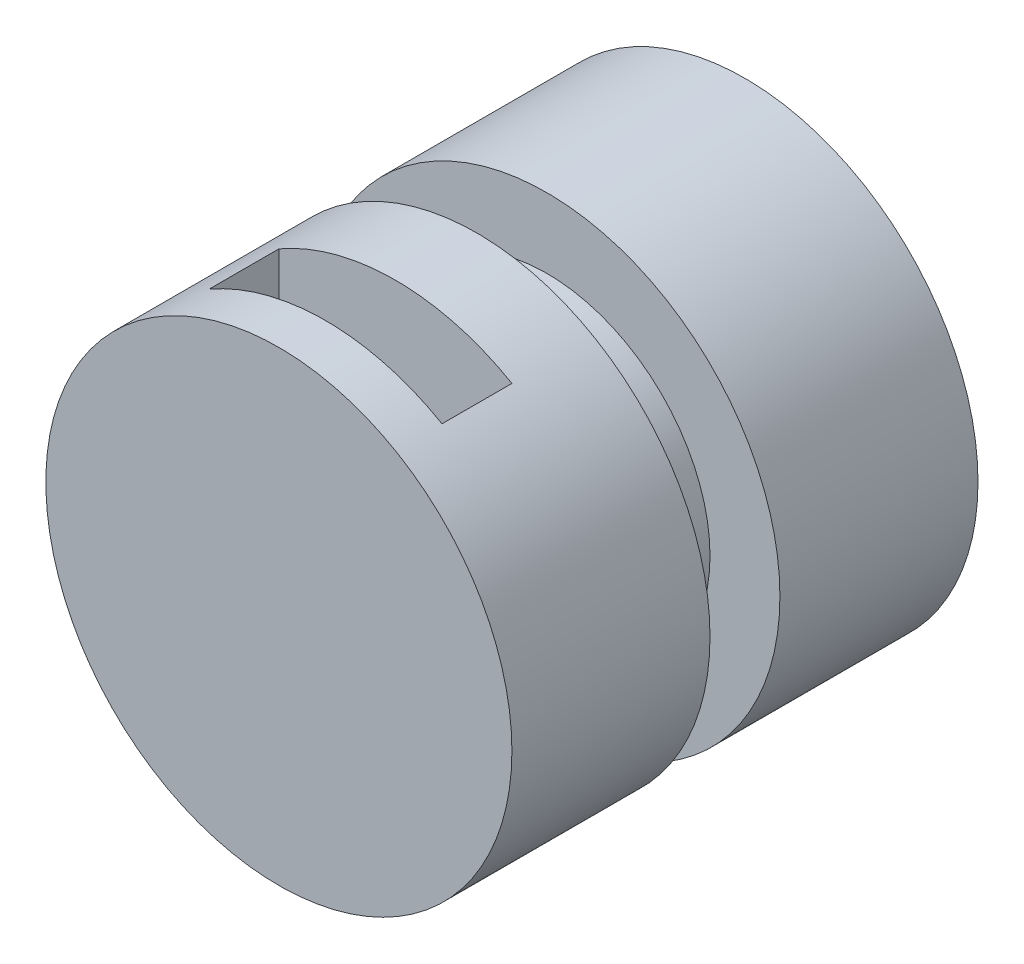
ISO-10303-21;
HEADER;
FILE_DESCRIPTION(('STEP AP214'),'2;1');
FILE_NAME('part.step','',(''),(''),'','','');
FILE_SCHEMA(('AUTOMOTIVE_DESIGN { 1 0 10303 214 1 1 1 1 }'));
ENDSEC;
DATA;
#1=APPLICATION_CONTEXT('core data for automotive mechanical design processes');
#2=APPLICATION_PROTOCOL_DEFINITION('international standard','automotive_design',2000,#1);
#3=PRODUCT_CONTEXT('',#1,'mechanical');
#4=PRODUCT('Part','Part','',(#3));
#5=PRODUCT_RELATED_PRODUCT_CATEGORY('part','',(#4));
#6=PRODUCT_DEFINITION_FORMATION('','',#4);
#7=PRODUCT_DEFINITION_CONTEXT('part definition',#1,'design');
#8=PRODUCT_DEFINITION('design','',#6,#7);
#9=PRODUCT_DEFINITION_SHAPE('','',#8);
#10=(LENGTH_UNIT() NAMED_UNIT(*) SI_UNIT(.MILLI.,.METRE.));
#11=(NAMED_UNIT(*) PLANE_ANGLE_UNIT() SI_UNIT($,.RADIAN.));
#12=(NAMED_UNIT(*) SI_UNIT($,.STERADIAN.) SOLID_ANGLE_UNIT());
#13=UNCERTAINTY_MEASURE_WITH_UNIT(LENGTH_MEASURE(1.E-05),#10,'distance_accuracy_value','');
#14=(GEOMETRIC_REPRESENTATION_CONTEXT(3) GLOBAL_UNCERTAINTY_ASSIGNED_CONTEXT((#13)) GLOBAL_UNIT_ASSIGNED_CONTEXT((#10,
#11,#12)) REPRESENTATION_CONTEXT('',''));
#15=CARTESIAN_POINT('',(0.,0.,0.));
#16=DIRECTION('',(0.,0.,1.));
#17=DIRECTION('',(1.,0.,0.));
#18=AXIS2_PLACEMENT_3D('',#15,#16,#17);
#19=CARTESIAN_POINT('',(0.,0.,5.47950703664449E-12));
#20=DIRECTION('',(0.,0.,1.));
#21=DIRECTION('',(1.,0.,0.));
#22=AXIS2_PLACEMENT_3D('',#19,#20,#21);
#23=PLANE('',#22);
#24=CARTESIAN_POINT('',(0.,0.,1.11022302462516E-11));
#25=DIRECTION('',(0.,0.,1.));
#26=DIRECTION('',(1.,0.,0.));
#27=AXIS2_PLACEMENT_3D('',#24,#25,#26);
#28=CIRCLE('',#27,1000.);
#29=CARTESIAN_POINT('',(1000.,0.,1.33797342119491E-11));
#30=VERTEX_POINT('',#29);
#31=EDGE_CURVE('E78',#30,#30,#28,.T.);
#32=ORIENTED_EDGE('',*,*,#31,.F.);
#33=EDGE_LOOP('',(#32));
#34=FACE_BOUND('',#33,.T.);
#35=ADVANCED_FACE('F35',(#34),#23,.F.);
#36=CARTESIAN_POINT('',(-4.55500793139507E-12,0.,2000.00000000001));
#37=DIRECTION('',(0.,0.,1.));
#38=DIRECTION('',(1.,0.,0.));
#39=AXIS2_PLACEMENT_3D('',#36,#37,#38);
#40=CYLINDRICAL_SURFACE('',#39,999.999999999998);
#41=CARTESIAN_POINT('',(-1.93587837084293E-12,0.,850.000000000015));
#42=DIRECTION('',(0.,0.,1.));
#43=DIRECTION('',(1.,0.,0.));
#44=AXIS2_PLACEMENT_3D('',#41,#42,#43);
#45=CIRCLE('',#44,999.999999999998);
#46=CARTESIAN_POINT('',(999.999999999996,0.,850.000000000018));
#47=VERTEX_POINT('',#46);
#48=EDGE_CURVE('E119',#47,#47,#45,.T.);
#49=ORIENTED_EDGE('',*,*,#48,.F.);
#50=EDGE_LOOP('',(#49));
#51=FACE_BOUND('',#50,.T.);
#52=ORIENTED_EDGE('',*,*,#31,.T.);
#53=EDGE_LOOP('',(#52));
#54=FACE_BOUND('',#53,.T.);
#55=ADVANCED_FACE('F125',(#51,#54),#40,.T.);
#56=CARTESIAN_POINT('',(-1000.,0.,850.000000000013));
#57=DIRECTION('',(0.,0.,-1.));
#58=DIRECTION('',(-1.,0.,0.));
#59=AXIS2_PLACEMENT_3D('',#56,#57,#58);
#60=PLANE('',#59);
#61=CARTESIAN_POINT('',(-1.93587837084292E-12,0.,850.000000000015));
#62=DIRECTION('',(0.,0.,1.));
#63=DIRECTION('',(1.,0.,0.));
#64=AXIS2_PLACEMENT_3D('',#61,#62,#63);
#65=CIRCLE('',#64,699.999999999998);
#66=CARTESIAN_POINT('',(699.999999999996,0.,850.000000000016));
#67=VERTEX_POINT('',#66);
#68=EDGE_CURVE('E106',#67,#67,#65,.T.);
#69=ORIENTED_EDGE('',*,*,#68,.F.);
#70=EDGE_LOOP('',(#69));
#71=FACE_BOUND('',#70,.T.);
#72=ORIENTED_EDGE('',*,*,#48,.T.);
#73=EDGE_LOOP('',(#72));
#74=FACE_BOUND('',#73,.T.);
#75=ADVANCED_FACE('F123',(#71,#74),#60,.F.);
#76=CARTESIAN_POINT('',(-4.55500793139507E-12,0.,2000.00000000001));
#77=DIRECTION('',(0.,0.,1.));
#78=DIRECTION('',(1.,0.,0.));
#79=AXIS2_PLACEMENT_3D('',#76,#77,#78);
#80=CYLINDRICAL_SURFACE('',#79,699.999999999997);
#81=CARTESIAN_POINT('',(-2.61912956055218E-12,0.,1150.00000000001));
#82=DIRECTION('',(0.,0.,1.));
#83=DIRECTION('',(1.,0.,0.));
#84=AXIS2_PLACEMENT_3D('',#81,#82,#83);
#85=CIRCLE('',#84,699.999999999997);
#86=CARTESIAN_POINT('',(699.999999999994,0.,1150.00000000002));
#87=VERTEX_POINT('',#86);
#88=EDGE_CURVE('E113',#87,#87,#85,.T.);
#89=ORIENTED_EDGE('',*,*,#88,.F.);
#90=EDGE_LOOP('',(#89));
#91=FACE_BOUND('',#90,.T.);
#92=ORIENTED_EDGE('',*,*,#68,.T.);
#93=EDGE_LOOP('',(#92));
#94=FACE_BOUND('',#93,.T.);
#95=ADVANCED_FACE('F145',(#91,#94),#80,.T.);
#96=CARTESIAN_POINT('',(-999.999999999999,0.,1150.00000000001));
#97=DIRECTION('',(0.,0.,-1.));
#98=DIRECTION('',(-1.,0.,0.));
#99=AXIS2_PLACEMENT_3D('',#96,#97,#98);
#100=PLANE('',#99);
#101=ORIENTED_EDGE('',*,*,#88,.T.);
#102=EDGE_LOOP('',(#101));
#103=FACE_BOUND('',#102,.T.);
#104=CARTESIAN_POINT('',(-2.61912956055218E-12,0.,1150.00000000002));
#105=DIRECTION('',(0.,0.,1.));
#106=DIRECTION('',(1.,0.,0.));
#107=AXIS2_PLACEMENT_3D('',#104,#105,#106);
#108=CIRCLE('',#107,999.999999999997);
#109=CARTESIAN_POINT('',(999.999999999994,0.,1150.00000000002));
#110=VERTEX_POINT('',#109);
#111=EDGE_CURVE('E116',#110,#110,#108,.T.);
#112=ORIENTED_EDGE('',*,*,#111,.F.);
#113=EDGE_LOOP('',(#112));
#114=FACE_BOUND('',#113,.T.);
#115=ADVANCED_FACE('F153',(#103,#114),#100,.T.);
#116=CARTESIAN_POINT('',(499.999999999996,-1000.,1800.00000000001));
#117=DIRECTION('',(0.,0.,1.));
#118=DIRECTION('',(1.,0.,0.));
#119=AXIS2_PLACEMENT_3D('',#116,#117,#118);
#120=PLANE('',#119);
#121=DIRECTION('',(0.,1.,0.));
#122=VECTOR('',#121,1.);
#123=CARTESIAN_POINT('',(499.999999999996,-1000.,1800.00000000001));
#124=LINE('',#123,#122);
#125=CARTESIAN_POINT('',(499.999999999996,-866.025403784436,1800.00000000001));
#126=VERTEX_POINT('',#125);
#127=CARTESIAN_POINT('',(499.999999999996,866.025403784436,1800.00000000001));
#128=VERTEX_POINT('',#127);
#129=EDGE_CURVE('E105',#126,#128,#124,.T.);
#130=ORIENTED_EDGE('',*,*,#129,.F.);
#131=CARTESIAN_POINT('',(-4.09950713825555E-12,0.,1800.00000000001));
#132=DIRECTION('',(0.,0.,1.));
#133=DIRECTION('',(1.,0.,0.));
#134=AXIS2_PLACEMENT_3D('',#131,#132,#133);
#135=CIRCLE('',#134,999.999999999998);
#136=CARTESIAN_POINT('',(-500.000000000004,-866.025403784436,1800.00000000001));
#137=VERTEX_POINT('',#136);
#138=EDGE_CURVE('E42',#137,#126,#135,.T.);
#139=ORIENTED_EDGE('',*,*,#138,.F.);
#140=DIRECTION('',(0.,1.,0.));
#141=VECTOR('',#140,1.);
#142=CARTESIAN_POINT('',(-500.000000000004,-1000.,1800.00000000001));
#143=LINE('',#142,#141);
#144=CARTESIAN_POINT('',(-500.000000000004,866.025403784436,1800.00000000001));
#145=VERTEX_POINT('',#144);
#146=EDGE_CURVE('E89',#137,#145,#143,.T.);
#147=ORIENTED_EDGE('',*,*,#146,.T.);
#148=EDGE_CURVE('E77',#128,#145,#135,.T.);
#149=ORIENTED_EDGE('',*,*,#148,.F.);
#150=EDGE_LOOP('',(#130,#139,#147,#149));
#151=FACE_BOUND('',#150,.T.);
#152=ADVANCED_FACE('F161',(#151),#120,.F.);
#153=CARTESIAN_POINT('',(499.999999999996,-1000.,1800.00000000001));
#154=DIRECTION('',(1.,0.,0.));
#155=DIRECTION('',(0.,0.,-1.));
#156=AXIS2_PLACEMENT_3D('',#153,#154,#155);
#157=PLANE('',#156);
#158=DIRECTION('',(0.,1.,0.));
#159=VECTOR('',#158,1.);
#160=CARTESIAN_POINT('',(499.999999999996,-1000.,1500.00000000001));
#161=LINE('',#160,#159);
#162=CARTESIAN_POINT('',(499.999999999996,-866.025403784436,1500.00000000001));
#163=VERTEX_POINT('',#162);
#164=CARTESIAN_POINT('',(499.999999999996,866.025403784436,1500.00000000001));
#165=VERTEX_POINT('',#164);
#166=EDGE_CURVE('E54',#163,#165,#161,.T.);
#167=ORIENTED_EDGE('',*,*,#166,.F.);
#168=DIRECTION('',(0.,0.,1.));
#169=VECTOR('',#168,1.);
#170=CARTESIAN_POINT('',(499.999999999996,-866.025403784436,2000.00000000001));
#171=LINE('',#170,#169);
#172=EDGE_CURVE('E11',#126,#163,#171,.F.);
#173=ORIENTED_EDGE('',*,*,#172,.F.);
#174=ORIENTED_EDGE('',*,*,#129,.T.);
#175=DIRECTION('',(0.,0.,1.));
#176=VECTOR('',#175,1.);
#177=CARTESIAN_POINT('',(499.999999999996,866.025403784436,2000.00000000001));
#178=LINE('',#177,#176);
#179=EDGE_CURVE('E94',#165,#128,#178,.T.);
#180=ORIENTED_EDGE('',*,*,#179,.F.);
#181=EDGE_LOOP('',(#167,#173,#174,#180));
#182=FACE_BOUND('',#181,.T.);
#183=ADVANCED_FACE('F170',(#182),#157,.F.);
#184=CARTESIAN_POINT('',(499.999999999996,-1000.,1500.00000000001));
#185=DIRECTION('',(0.,0.,-1.));
#186=DIRECTION('',(-1.,0.,0.));
#187=AXIS2_PLACEMENT_3D('',#184,#185,#186);
#188=PLANE('',#187);
#189=DIRECTION('',(0.,1.,0.));
#190=VECTOR('',#189,1.);
#191=CARTESIAN_POINT('',(-500.000000000004,-1000.,1500.00000000001));
#192=LINE('',#191,#190);
#193=CARTESIAN_POINT('',(-500.000000000004,-866.025403784436,1500.00000000001));
#194=VERTEX_POINT('',#193);
#195=CARTESIAN_POINT('',(-500.000000000004,866.025403784436,1500.00000000001));
#196=VERTEX_POINT('',#195);
#197=EDGE_CURVE('E49',#194,#196,#192,.T.);
#198=ORIENTED_EDGE('',*,*,#197,.F.);
#199=CARTESIAN_POINT('',(-3.4162559485463E-12,0.,1500.00000000001));
#200=DIRECTION('',(0.,0.,-1.));
#201=DIRECTION('',(-1.,0.,0.));
#202=AXIS2_PLACEMENT_3D('',#199,#200,#201);
#203=CIRCLE('',#202,999.999999999998);
#204=EDGE_CURVE('E80',#163,#194,#203,.T.);
#205=ORIENTED_EDGE('',*,*,#204,.F.);
#206=ORIENTED_EDGE('',*,*,#166,.T.);
#207=EDGE_CURVE('E72',#196,#165,#203,.T.);
#208=ORIENTED_EDGE('',*,*,#207,.F.);
#209=EDGE_LOOP('',(#198,#205,#206,#208));
#210=FACE_BOUND('',#209,.T.);
#211=ADVANCED_FACE('F73',(#210),#188,.F.);
#212=CARTESIAN_POINT('',(-500.000000000004,-1000.,1800.00000000001));
#213=DIRECTION('',(-1.,0.,0.));
#214=DIRECTION('',(0.,0.,1.));
#215=AXIS2_PLACEMENT_3D('',#212,#213,#214);
#216=PLANE('',#215);
#217=ORIENTED_EDGE('',*,*,#197,.T.);
#218=DIRECTION('',(0.,0.,1.));
#219=VECTOR('',#218,1.);
#220=CARTESIAN_POINT('',(-500.000000000004,866.025403784436,2000.00000000001));
#221=LINE('',#220,#219);
#222=EDGE_CURVE('E84',#145,#196,#221,.F.);
#223=ORIENTED_EDGE('',*,*,#222,.F.);
#224=ORIENTED_EDGE('',*,*,#146,.F.);
#225=DIRECTION('',(0.,0.,1.));
#226=VECTOR('',#225,1.);
#227=CARTESIAN_POINT('',(-500.000000000004,-866.025403784436,2000.00000000001));
#228=LINE('',#227,#226);
#229=EDGE_CURVE('E87',#194,#137,#228,.T.);
#230=ORIENTED_EDGE('',*,*,#229,.F.);
#231=EDGE_LOOP('',(#217,#223,#224,#230));
#232=FACE_BOUND('',#231,.T.);
#233=ADVANCED_FACE('F82',(#232),#216,.F.);
#234=CARTESIAN_POINT('',(-4.55500793139506E-12,0.,2000.00000000001));
#235=DIRECTION('',(0.,0.,-1.));
#236=DIRECTION('',(-1.,0.,0.));
#237=AXIS2_PLACEMENT_3D('',#234,#235,#236);
#238=PLANE('',#237);
#239=CARTESIAN_POINT('',(-4.55500793139506E-12,0.,2000.00000000001));
#240=DIRECTION('',(0.,0.,1.));
#241=DIRECTION('',(1.,0.,0.));
#242=AXIS2_PLACEMENT_3D('',#239,#240,#241);
#243=CIRCLE('',#242,999.999999999995);
#244=CARTESIAN_POINT('',(999.99999999999,0.,2000.00000000001));
#245=VERTEX_POINT('',#244);
#246=EDGE_CURVE('E102',#245,#245,#243,.T.);
#247=ORIENTED_EDGE('',*,*,#246,.T.);
#248=EDGE_LOOP('',(#247));
#249=FACE_BOUND('',#248,.T.);
#250=ADVANCED_FACE('F190',(#249),#238,.F.);
#251=ORIENTED_EDGE('',*,*,#246,.F.);
#252=EDGE_LOOP('',(#251));
#253=FACE_BOUND('',#252,.T.);
#254=ORIENTED_EDGE('',*,*,#222,.T.);
#255=ORIENTED_EDGE('',*,*,#207,.T.);
#256=ORIENTED_EDGE('',*,*,#179,.T.);
#257=ORIENTED_EDGE('',*,*,#148,.T.);
#258=EDGE_LOOP('',(#254,#255,#256,#257));
#259=FACE_BOUND('',#258,.T.);
#260=ORIENTED_EDGE('',*,*,#172,.T.);
#261=ORIENTED_EDGE('',*,*,#204,.T.);
#262=ORIENTED_EDGE('',*,*,#229,.T.);
#263=ORIENTED_EDGE('',*,*,#138,.T.);
#264=EDGE_LOOP('',(#260,#261,#262,#263));
#265=FACE_BOUND('',#264,.T.);
#266=ORIENTED_EDGE('',*,*,#111,.T.);
#267=EDGE_LOOP('',(#266));
#268=FACE_BOUND('',#267,.T.);
#269=ADVANCED_FACE('F92',(#253,#259,#265,#268),#40,.T.);
#270=CLOSED_SHELL('',(#35,#55,#75,#95,#115,#152,#183,#211,#233,#250,#269));
#271=MANIFOLD_SOLID_BREP('B2',#270);
#272=ADVANCED_BREP_SHAPE_REPRESENTATION('',(#18,#271),#14);
#273=SHAPE_DEFINITION_REPRESENTATION(#9,#272);
ENDSEC;
END-ISO-10303-21;
